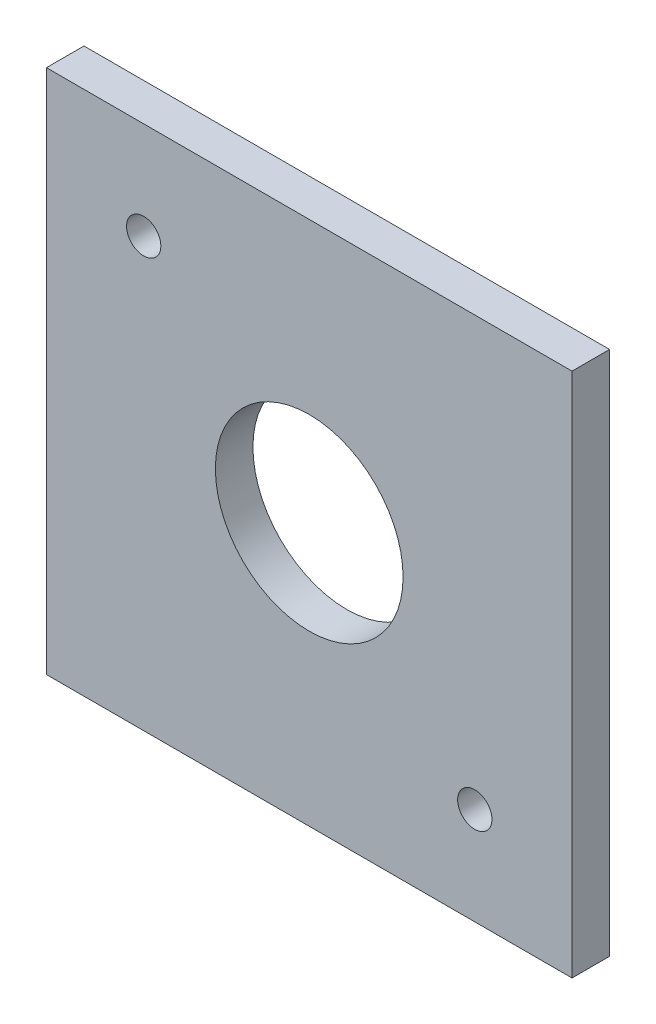
ISO-10303-21;
HEADER;
FILE_DESCRIPTION(('STEP AP214'),'2;1');
FILE_NAME('part.step','',(''),(''),'','','');
FILE_SCHEMA(('AUTOMOTIVE_DESIGN { 1 0 10303 214 1 1 1 1 }'));
ENDSEC;
DATA;
#1=APPLICATION_CONTEXT('core data for automotive mechanical design processes');
#2=APPLICATION_PROTOCOL_DEFINITION('international standard','automotive_design',2000,#1);
#3=PRODUCT_CONTEXT('',#1,'mechanical');
#4=PRODUCT('Part','Part','',(#3));
#5=PRODUCT_RELATED_PRODUCT_CATEGORY('part','',(#4));
#6=PRODUCT_DEFINITION_FORMATION('','',#4);
#7=PRODUCT_DEFINITION_CONTEXT('part definition',#1,'design');
#8=PRODUCT_DEFINITION('design','',#6,#7);
#9=PRODUCT_DEFINITION_SHAPE('','',#8);
#10=(LENGTH_UNIT() NAMED_UNIT(*) SI_UNIT(.MILLI.,.METRE.));
#11=(NAMED_UNIT(*) PLANE_ANGLE_UNIT() SI_UNIT($,.RADIAN.));
#12=(NAMED_UNIT(*) SI_UNIT($,.STERADIAN.) SOLID_ANGLE_UNIT());
#13=UNCERTAINTY_MEASURE_WITH_UNIT(LENGTH_MEASURE(1.E-05),#10,'distance_accuracy_value','');
#14=(GEOMETRIC_REPRESENTATION_CONTEXT(3) GLOBAL_UNCERTAINTY_ASSIGNED_CONTEXT((#13)) GLOBAL_UNIT_ASSIGNED_CONTEXT((#10,
#11,#12)) REPRESENTATION_CONTEXT('',''));
#15=CARTESIAN_POINT('',(0.,0.,0.));
#16=DIRECTION('',(0.,0.,1.));
#17=DIRECTION('',(1.,0.,0.));
#18=AXIS2_PLACEMENT_3D('',#15,#16,#17);
#19=CARTESIAN_POINT('',(22.225,-22.225,3.175));
#20=DIRECTION('',(-1.,0.,0.));
#21=DIRECTION('',(0.,0.,1.));
#22=AXIS2_PLACEMENT_3D('',#19,#20,#21);
#23=PLANE('',#22);
#24=DIRECTION('',(0.,1.,0.));
#25=VECTOR('',#24,1.);
#26=CARTESIAN_POINT('',(22.225,-22.225,0.));
#27=LINE('',#26,#25);
#28=CARTESIAN_POINT('',(22.225,-22.225,0.));
#29=VERTEX_POINT('',#28);
#30=CARTESIAN_POINT('',(22.225,22.225,0.));
#31=VERTEX_POINT('',#30);
#32=EDGE_CURVE('E104',#29,#31,#27,.T.);
#33=ORIENTED_EDGE('',*,*,#32,.T.);
#34=DIRECTION('',(0.,0.,-1.));
#35=VECTOR('',#34,1.);
#36=CARTESIAN_POINT('',(22.225,22.225,3.175));
#37=LINE('',#36,#35);
#38=CARTESIAN_POINT('',(22.225,22.225,3.175));
#39=VERTEX_POINT('',#38);
#40=EDGE_CURVE('E11',#39,#31,#37,.T.);
#41=ORIENTED_EDGE('',*,*,#40,.F.);
#42=DIRECTION('',(0.,1.,0.));
#43=VECTOR('',#42,1.);
#44=CARTESIAN_POINT('',(22.225,-22.225,3.175));
#45=LINE('',#44,#43);
#46=CARTESIAN_POINT('',(22.225,-22.225,3.175));
#47=VERTEX_POINT('',#46);
#48=EDGE_CURVE('E92',#47,#39,#45,.T.);
#49=ORIENTED_EDGE('',*,*,#48,.F.);
#50=DIRECTION('',(0.,0.,-1.));
#51=VECTOR('',#50,1.);
#52=CARTESIAN_POINT('',(22.225,-22.225,3.175));
#53=LINE('',#52,#51);
#54=EDGE_CURVE('E100',#47,#29,#53,.T.);
#55=ORIENTED_EDGE('',*,*,#54,.T.);
#56=EDGE_LOOP('',(#33,#41,#49,#55));
#57=FACE_BOUND('',#56,.T.);
#58=ADVANCED_FACE('F41',(#57),#23,.F.);
#59=CARTESIAN_POINT('',(-22.225,22.225,3.175));
#60=DIRECTION('',(0.,-1.,0.));
#61=DIRECTION('',(0.,0.,-1.));
#62=AXIS2_PLACEMENT_3D('',#59,#60,#61);
#63=PLANE('',#62);
#64=DIRECTION('',(-1.,0.,0.));
#65=VECTOR('',#64,1.);
#66=CARTESIAN_POINT('',(-22.225,22.225,0.));
#67=LINE('',#66,#65);
#68=CARTESIAN_POINT('',(-22.225,22.225,0.));
#69=VERTEX_POINT('',#68);
#70=EDGE_CURVE('E96',#31,#69,#67,.T.);
#71=ORIENTED_EDGE('',*,*,#70,.T.);
#72=DIRECTION('',(0.,0.,-1.));
#73=VECTOR('',#72,1.);
#74=CARTESIAN_POINT('',(-22.225,22.225,3.175));
#75=LINE('',#74,#73);
#76=CARTESIAN_POINT('',(-22.225,22.225,3.175));
#77=VERTEX_POINT('',#76);
#78=EDGE_CURVE('E49',#77,#69,#75,.T.);
#79=ORIENTED_EDGE('',*,*,#78,.F.);
#80=DIRECTION('',(-1.,0.,0.));
#81=VECTOR('',#80,1.);
#82=CARTESIAN_POINT('',(-22.225,22.225,3.175));
#83=LINE('',#82,#81);
#84=EDGE_CURVE('E87',#39,#77,#83,.T.);
#85=ORIENTED_EDGE('',*,*,#84,.F.);
#86=ORIENTED_EDGE('',*,*,#40,.T.);
#87=EDGE_LOOP('',(#71,#79,#85,#86));
#88=FACE_BOUND('',#87,.T.);
#89=ADVANCED_FACE('F95',(#88),#63,.F.);
#90=CARTESIAN_POINT('',(-22.225,-22.225,3.175));
#91=DIRECTION('',(1.,0.,0.));
#92=DIRECTION('',(0.,0.,-1.));
#93=AXIS2_PLACEMENT_3D('',#90,#91,#92);
#94=PLANE('',#93);
#95=DIRECTION('',(0.,-1.,0.));
#96=VECTOR('',#95,1.);
#97=CARTESIAN_POINT('',(-22.225,-22.225,0.));
#98=LINE('',#97,#96);
#99=CARTESIAN_POINT('',(-22.225,-22.225,0.));
#100=VERTEX_POINT('',#99);
#101=EDGE_CURVE('E74',#69,#100,#98,.T.);
#102=ORIENTED_EDGE('',*,*,#101,.T.);
#103=DIRECTION('',(0.,0.,-1.));
#104=VECTOR('',#103,1.);
#105=CARTESIAN_POINT('',(-22.225,-22.225,3.175));
#106=LINE('',#105,#104);
#107=CARTESIAN_POINT('',(-22.225,-22.225,3.175));
#108=VERTEX_POINT('',#107);
#109=EDGE_CURVE('E97',#108,#100,#106,.T.);
#110=ORIENTED_EDGE('',*,*,#109,.F.);
#111=DIRECTION('',(0.,-1.,0.));
#112=VECTOR('',#111,1.);
#113=CARTESIAN_POINT('',(-22.225,-22.225,3.175));
#114=LINE('',#113,#112);
#115=EDGE_CURVE('E90',#77,#108,#114,.T.);
#116=ORIENTED_EDGE('',*,*,#115,.F.);
#117=ORIENTED_EDGE('',*,*,#78,.T.);
#118=EDGE_LOOP('',(#102,#110,#116,#117));
#119=FACE_BOUND('',#118,.T.);
#120=ADVANCED_FACE('F98',(#119),#94,.F.);
#121=CARTESIAN_POINT('',(-22.225,-22.225,3.175));
#122=DIRECTION('',(0.,1.,0.));
#123=DIRECTION('',(0.,0.,1.));
#124=AXIS2_PLACEMENT_3D('',#121,#122,#123);
#125=PLANE('',#124);
#126=DIRECTION('',(1.,0.,0.));
#127=VECTOR('',#126,1.);
#128=CARTESIAN_POINT('',(-22.225,-22.225,0.));
#129=LINE('',#128,#127);
#130=EDGE_CURVE('E80',#100,#29,#129,.T.);
#131=ORIENTED_EDGE('',*,*,#130,.T.);
#132=ORIENTED_EDGE('',*,*,#54,.F.);
#133=DIRECTION('',(1.,0.,0.));
#134=VECTOR('',#133,1.);
#135=CARTESIAN_POINT('',(-22.225,-22.225,3.175));
#136=LINE('',#135,#134);
#137=EDGE_CURVE('E57',#108,#47,#136,.T.);
#138=ORIENTED_EDGE('',*,*,#137,.F.);
#139=ORIENTED_EDGE('',*,*,#109,.T.);
#140=EDGE_LOOP('',(#131,#132,#138,#139));
#141=FACE_BOUND('',#140,.T.);
#142=ADVANCED_FACE('F112',(#141),#125,.F.);
#143=CARTESIAN_POINT('',(0.,0.,3.175));
#144=DIRECTION('',(0.,0.,-1.));
#145=DIRECTION('',(-1.,0.,0.));
#146=AXIS2_PLACEMENT_3D('',#143,#144,#145);
#147=PLANE('',#146);
#148=CARTESIAN_POINT('',(0.,0.,3.175));
#149=DIRECTION('',(0.,0.,1.));
#150=DIRECTION('',(1.,0.,0.));
#151=AXIS2_PLACEMENT_3D('',#148,#149,#150);
#152=CIRCLE('',#151,7.9375);
#153=CARTESIAN_POINT('',(7.9375,0.,3.175));
#154=VERTEX_POINT('',#153);
#155=EDGE_CURVE('E130',#154,#154,#152,.T.);
#156=ORIENTED_EDGE('',*,*,#155,.F.);
#157=EDGE_LOOP('',(#156));
#158=FACE_BOUND('',#157,.T.);
#159=CARTESIAN_POINT('',(-14.,14.,3.175));
#160=DIRECTION('',(0.,0.,1.));
#161=DIRECTION('',(1.,0.,0.));
#162=AXIS2_PLACEMENT_3D('',#159,#160,#161);
#163=CIRCLE('',#162,1.45);
#164=CARTESIAN_POINT('',(-12.55,14.,3.175));
#165=VERTEX_POINT('',#164);
#166=EDGE_CURVE('E126',#165,#165,#163,.T.);
#167=ORIENTED_EDGE('',*,*,#166,.F.);
#168=EDGE_LOOP('',(#167));
#169=FACE_BOUND('',#168,.T.);
#170=CARTESIAN_POINT('',(14.,-14.,3.175));
#171=DIRECTION('',(0.,0.,1.));
#172=DIRECTION('',(1.,0.,0.));
#173=AXIS2_PLACEMENT_3D('',#170,#171,#172);
#174=CIRCLE('',#173,1.45);
#175=CARTESIAN_POINT('',(15.45,-14.,3.175));
#176=VERTEX_POINT('',#175);
#177=EDGE_CURVE('E120',#176,#176,#174,.T.);
#178=ORIENTED_EDGE('',*,*,#177,.F.);
#179=EDGE_LOOP('',(#178));
#180=FACE_BOUND('',#179,.T.);
#181=ORIENTED_EDGE('',*,*,#48,.T.);
#182=ORIENTED_EDGE('',*,*,#84,.T.);
#183=ORIENTED_EDGE('',*,*,#115,.T.);
#184=ORIENTED_EDGE('',*,*,#137,.T.);
#185=EDGE_LOOP('',(#181,#182,#183,#184));
#186=FACE_BOUND('',#185,.T.);
#187=ADVANCED_FACE('F88',(#158,#169,#180,#186),#147,.F.);
#188=CARTESIAN_POINT('',(0.,0.,0.));
#189=DIRECTION('',(0.,0.,-1.));
#190=DIRECTION('',(-1.,0.,0.));
#191=AXIS2_PLACEMENT_3D('',#188,#189,#190);
#192=PLANE('',#191);
#193=CARTESIAN_POINT('',(0.,0.,0.));
#194=DIRECTION('',(0.,0.,1.));
#195=DIRECTION('',(1.,0.,0.));
#196=AXIS2_PLACEMENT_3D('',#193,#194,#195);
#197=CIRCLE('',#196,7.9375);
#198=CARTESIAN_POINT('',(7.9375,0.,0.));
#199=VERTEX_POINT('',#198);
#200=EDGE_CURVE('E129',#199,#199,#197,.T.);
#201=ORIENTED_EDGE('',*,*,#200,.T.);
#202=EDGE_LOOP('',(#201));
#203=FACE_BOUND('',#202,.T.);
#204=CARTESIAN_POINT('',(-14.,14.,0.));
#205=DIRECTION('',(0.,0.,1.));
#206=DIRECTION('',(1.,0.,0.));
#207=AXIS2_PLACEMENT_3D('',#204,#205,#206);
#208=CIRCLE('',#207,1.45);
#209=CARTESIAN_POINT('',(-12.55,14.,0.));
#210=VERTEX_POINT('',#209);
#211=EDGE_CURVE('E123',#210,#210,#208,.T.);
#212=ORIENTED_EDGE('',*,*,#211,.T.);
#213=EDGE_LOOP('',(#212));
#214=FACE_BOUND('',#213,.T.);
#215=CARTESIAN_POINT('',(14.,-14.,0.));
#216=DIRECTION('',(0.,0.,1.));
#217=DIRECTION('',(1.,0.,0.));
#218=AXIS2_PLACEMENT_3D('',#215,#216,#217);
#219=CIRCLE('',#218,1.45);
#220=CARTESIAN_POINT('',(15.45,-14.,0.));
#221=VERTEX_POINT('',#220);
#222=EDGE_CURVE('E107',#221,#221,#219,.T.);
#223=ORIENTED_EDGE('',*,*,#222,.T.);
#224=EDGE_LOOP('',(#223));
#225=FACE_BOUND('',#224,.T.);
#226=ORIENTED_EDGE('',*,*,#32,.F.);
#227=ORIENTED_EDGE('',*,*,#130,.F.);
#228=ORIENTED_EDGE('',*,*,#101,.F.);
#229=ORIENTED_EDGE('',*,*,#70,.F.);
#230=EDGE_LOOP('',(#226,#227,#228,#229));
#231=FACE_BOUND('',#230,.T.);
#232=ADVANCED_FACE('F115',(#203,#214,#225,#231),#192,.T.);
#233=CARTESIAN_POINT('',(14.,-14.,3.175));
#234=DIRECTION('',(0.,0.,1.));
#235=DIRECTION('',(1.,0.,0.));
#236=AXIS2_PLACEMENT_3D('',#233,#234,#235);
#237=CYLINDRICAL_SURFACE('',#236,1.45);
#238=ORIENTED_EDGE('',*,*,#222,.F.);
#239=EDGE_LOOP('',(#238));
#240=FACE_BOUND('',#239,.T.);
#241=ORIENTED_EDGE('',*,*,#177,.T.);
#242=EDGE_LOOP('',(#241));
#243=FACE_BOUND('',#242,.T.);
#244=ADVANCED_FACE('F152',(#240,#243),#237,.F.);
#245=CARTESIAN_POINT('',(-14.,14.,3.175));
#246=DIRECTION('',(0.,0.,1.));
#247=DIRECTION('',(1.,0.,0.));
#248=AXIS2_PLACEMENT_3D('',#245,#246,#247);
#249=CYLINDRICAL_SURFACE('',#248,1.45);
#250=ORIENTED_EDGE('',*,*,#211,.F.);
#251=EDGE_LOOP('',(#250));
#252=FACE_BOUND('',#251,.T.);
#253=ORIENTED_EDGE('',*,*,#166,.T.);
#254=EDGE_LOOP('',(#253));
#255=FACE_BOUND('',#254,.T.);
#256=ADVANCED_FACE('F141',(#252,#255),#249,.F.);
#257=CARTESIAN_POINT('',(0.,0.,0.));
#258=DIRECTION('',(0.,0.,1.));
#259=DIRECTION('',(1.,0.,0.));
#260=AXIS2_PLACEMENT_3D('',#257,#258,#259);
#261=CYLINDRICAL_SURFACE('',#260,7.9375);
#262=ORIENTED_EDGE('',*,*,#200,.F.);
#263=EDGE_LOOP('',(#262));
#264=FACE_BOUND('',#263,.T.);
#265=ORIENTED_EDGE('',*,*,#155,.T.);
#266=EDGE_LOOP('',(#265));
#267=FACE_BOUND('',#266,.T.);
#268=ADVANCED_FACE('F138',(#264,#267),#261,.F.);
#269=CLOSED_SHELL('',(#58,#89,#120,#142,#187,#232,#244,#256,#268));
#270=MANIFOLD_SOLID_BREP('B2',#269);
#271=ADVANCED_BREP_SHAPE_REPRESENTATION('',(#18,#270),#14);
#272=SHAPE_DEFINITION_REPRESENTATION(#9,#271);
ENDSEC;
END-ISO-10303-21;
